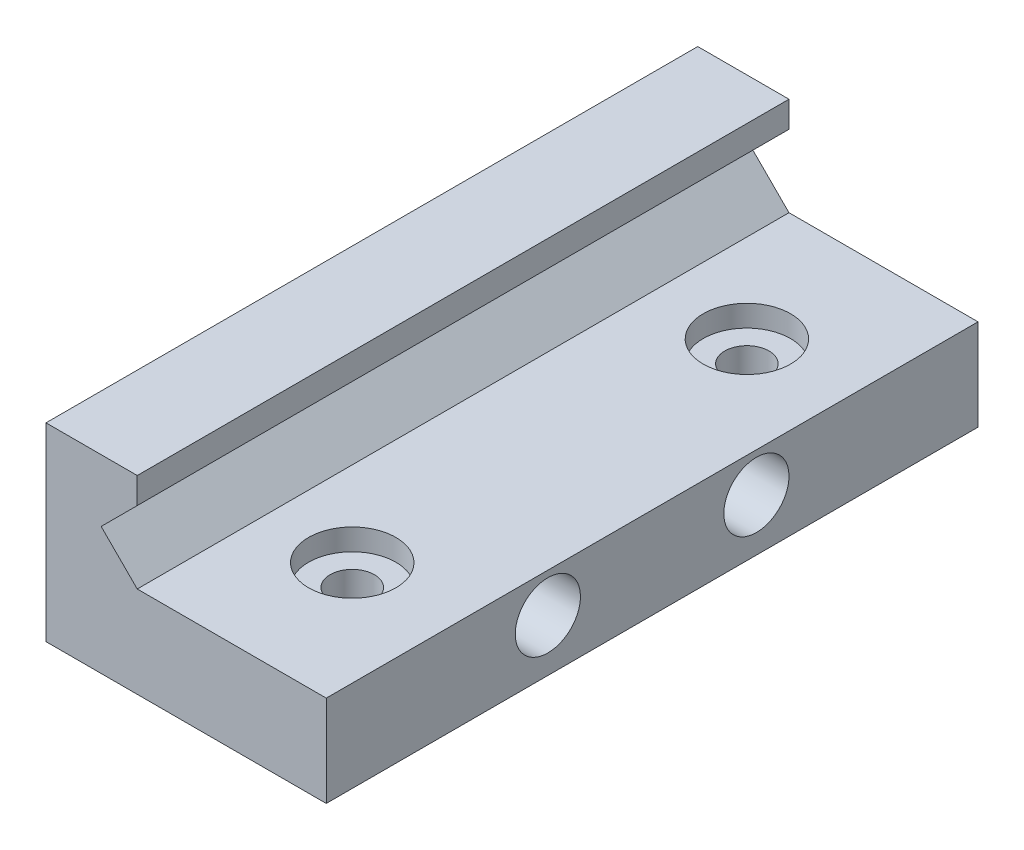
ISO-10303-21;
HEADER;
FILE_DESCRIPTION(('STEP AP214'),'2;1');
FILE_NAME('part.step','',(''),(''),'','','');
FILE_SCHEMA(('AUTOMOTIVE_DESIGN { 1 0 10303 214 1 1 1 1 }'));
ENDSEC;
DATA;
#1=APPLICATION_CONTEXT('core data for automotive mechanical design processes');
#2=APPLICATION_PROTOCOL_DEFINITION('international standard','automotive_design',2000,#1);
#3=PRODUCT_CONTEXT('',#1,'mechanical');
#4=PRODUCT('Part','Part','',(#3));
#5=PRODUCT_RELATED_PRODUCT_CATEGORY('part','',(#4));
#6=PRODUCT_DEFINITION_FORMATION('','',#4);
#7=PRODUCT_DEFINITION_CONTEXT('part definition',#1,'design');
#8=PRODUCT_DEFINITION('design','',#6,#7);
#9=PRODUCT_DEFINITION_SHAPE('','',#8);
#10=(LENGTH_UNIT() NAMED_UNIT(*) SI_UNIT(.MILLI.,.METRE.));
#11=(NAMED_UNIT(*) PLANE_ANGLE_UNIT() SI_UNIT($,.RADIAN.));
#12=(NAMED_UNIT(*) SI_UNIT($,.STERADIAN.) SOLID_ANGLE_UNIT());
#13=UNCERTAINTY_MEASURE_WITH_UNIT(LENGTH_MEASURE(1.E-05),#10,'distance_accuracy_value','');
#14=(GEOMETRIC_REPRESENTATION_CONTEXT(3) GLOBAL_UNCERTAINTY_ASSIGNED_CONTEXT((#13)) GLOBAL_UNIT_ASSIGNED_CONTEXT((#10,
#11,#12)) REPRESENTATION_CONTEXT('',''));
#15=CARTESIAN_POINT('',(0.,0.,0.));
#16=DIRECTION('',(0.,0.,1.));
#17=DIRECTION('',(1.,0.,0.));
#18=AXIS2_PLACEMENT_3D('',#15,#16,#17);
#19=CARTESIAN_POINT('',(-15.7134857516245,65.6371163031658,50.));
#20=DIRECTION('',(-1.,0.,0.));
#21=DIRECTION('',(0.,-1.,0.));
#22=AXIS2_PLACEMENT_3D('',#19,#20,#21);
#23=PLANE('',#22);
#24=DIRECTION('',(0.,1.,0.));
#25=VECTOR('',#24,1.);
#26=CARTESIAN_POINT('',(-15.7134857516245,65.6371163031658,0.));
#27=LINE('',#26,#25);
#28=CARTESIAN_POINT('',(-15.7134857516245,63.6371163031658,0.));
#29=VERTEX_POINT('',#28);
#30=CARTESIAN_POINT('',(-15.7134857516245,65.6371163031658,0.));
#31=VERTEX_POINT('',#30);
#32=EDGE_CURVE('E128',#29,#31,#27,.T.);
#33=ORIENTED_EDGE('',*,*,#32,.T.);
#34=DIRECTION('',(0.,0.,-1.));
#35=VECTOR('',#34,1.);
#36=CARTESIAN_POINT('',(-15.7134857516245,65.6371163031658,50.));
#37=LINE('',#36,#35);
#38=CARTESIAN_POINT('',(-15.7134857516245,65.6371163031658,50.));
#39=VERTEX_POINT('',#38);
#40=EDGE_CURVE('E11',#39,#31,#37,.T.);
#41=ORIENTED_EDGE('',*,*,#40,.F.);
#42=DIRECTION('',(0.,1.,0.));
#43=VECTOR('',#42,1.);
#44=CARTESIAN_POINT('',(-15.7134857516245,65.6371163031658,50.));
#45=LINE('',#44,#43);
#46=CARTESIAN_POINT('',(-15.7134857516245,63.6371163031658,50.));
#47=VERTEX_POINT('',#46);
#48=EDGE_CURVE('E143',#47,#39,#45,.T.);
#49=ORIENTED_EDGE('',*,*,#48,.F.);
#50=DIRECTION('',(0.,0.,-1.));
#51=VECTOR('',#50,1.);
#52=CARTESIAN_POINT('',(-15.7134857516245,63.6371163031658,50.));
#53=LINE('',#52,#51);
#54=EDGE_CURVE('E124',#47,#29,#53,.T.);
#55=ORIENTED_EDGE('',*,*,#54,.T.);
#56=EDGE_LOOP('',(#33,#41,#49,#55));
#57=FACE_BOUND('',#56,.T.);
#58=ADVANCED_FACE('F32',(#57),#23,.F.);
#59=CARTESIAN_POINT('',(-22.7134857516245,65.6371163031658,50.));
#60=DIRECTION('',(0.,-1.,0.));
#61=DIRECTION('',(0.,0.,-1.));
#62=AXIS2_PLACEMENT_3D('',#59,#60,#61);
#63=PLANE('',#62);
#64=DIRECTION('',(-1.,0.,0.));
#65=VECTOR('',#64,1.);
#66=CARTESIAN_POINT('',(-22.7134857516245,65.6371163031658,0.));
#67=LINE('',#66,#65);
#68=CARTESIAN_POINT('',(-22.7134857516245,65.6371163031658,0.));
#69=VERTEX_POINT('',#68);
#70=EDGE_CURVE('E131',#31,#69,#67,.T.);
#71=ORIENTED_EDGE('',*,*,#70,.T.);
#72=DIRECTION('',(0.,0.,-1.));
#73=VECTOR('',#72,1.);
#74=CARTESIAN_POINT('',(-22.7134857516245,65.6371163031658,50.));
#75=LINE('',#74,#73);
#76=CARTESIAN_POINT('',(-22.7134857516245,65.6371163031658,50.));
#77=VERTEX_POINT('',#76);
#78=EDGE_CURVE('E40',#77,#69,#75,.T.);
#79=ORIENTED_EDGE('',*,*,#78,.F.);
#80=DIRECTION('',(-1.,0.,0.));
#81=VECTOR('',#80,1.);
#82=CARTESIAN_POINT('',(-22.7134857516245,65.6371163031658,50.));
#83=LINE('',#82,#81);
#84=EDGE_CURVE('E91',#39,#77,#83,.T.);
#85=ORIENTED_EDGE('',*,*,#84,.F.);
#86=ORIENTED_EDGE('',*,*,#40,.T.);
#87=EDGE_LOOP('',(#71,#79,#85,#86));
#88=FACE_BOUND('',#87,.T.);
#89=ADVANCED_FACE('F237',(#88),#63,.F.);
#90=CARTESIAN_POINT('',(-22.7134857516245,51.0971163031658,50.));
#91=DIRECTION('',(1.,0.,0.));
#92=DIRECTION('',(0.,0.,-1.));
#93=AXIS2_PLACEMENT_3D('',#90,#91,#92);
#94=PLANE('',#93);
#95=CARTESIAN_POINT('',(-22.7134857516245,55.0971163031658,33.));
#96=DIRECTION('',(-1.,0.,0.));
#97=DIRECTION('',(0.,0.,1.));
#98=AXIS2_PLACEMENT_3D('',#95,#96,#97);
#99=CIRCLE('',#98,2.5);
#100=CARTESIAN_POINT('',(-22.7134857516245,55.0971163031658,35.5));
#101=VERTEX_POINT('',#100);
#102=EDGE_CURVE('E184',#101,#101,#99,.T.);
#103=ORIENTED_EDGE('',*,*,#102,.F.);
#104=EDGE_LOOP('',(#103));
#105=FACE_BOUND('',#104,.T.);
#106=CARTESIAN_POINT('',(-22.7134857516245,55.0971163031658,17.));
#107=DIRECTION('',(-1.,0.,0.));
#108=DIRECTION('',(0.,0.,1.));
#109=AXIS2_PLACEMENT_3D('',#106,#107,#108);
#110=CIRCLE('',#109,2.5);
#111=CARTESIAN_POINT('',(-22.7134857516245,55.0971163031658,19.5));
#112=VERTEX_POINT('',#111);
#113=EDGE_CURVE('E178',#112,#112,#110,.T.);
#114=ORIENTED_EDGE('',*,*,#113,.F.);
#115=EDGE_LOOP('',(#114));
#116=FACE_BOUND('',#115,.T.);
#117=DIRECTION('',(0.,-1.,0.));
#118=VECTOR('',#117,1.);
#119=CARTESIAN_POINT('',(-22.7134857516245,51.0971163031658,0.));
#120=LINE('',#119,#118);
#121=CARTESIAN_POINT('',(-22.7134857516245,51.0971163031658,0.));
#122=VERTEX_POINT('',#121);
#123=EDGE_CURVE('E134',#69,#122,#120,.T.);
#124=ORIENTED_EDGE('',*,*,#123,.T.);
#125=DIRECTION('',(0.,0.,-1.));
#126=VECTOR('',#125,1.);
#127=CARTESIAN_POINT('',(-22.7134857516245,51.0971163031658,50.));
#128=LINE('',#127,#126);
#129=CARTESIAN_POINT('',(-22.7134857516245,51.0971163031658,50.));
#130=VERTEX_POINT('',#129);
#131=EDGE_CURVE('E150',#130,#122,#128,.T.);
#132=ORIENTED_EDGE('',*,*,#131,.F.);
#133=DIRECTION('',(0.,-1.,0.));
#134=VECTOR('',#133,1.);
#135=CARTESIAN_POINT('',(-22.7134857516245,51.0971163031658,50.));
#136=LINE('',#135,#134);
#137=EDGE_CURVE('E158',#77,#130,#136,.T.);
#138=ORIENTED_EDGE('',*,*,#137,.F.);
#139=ORIENTED_EDGE('',*,*,#78,.T.);
#140=EDGE_LOOP('',(#124,#132,#138,#139));
#141=FACE_BOUND('',#140,.T.);
#142=ADVANCED_FACE('F156',(#105,#116,#141),#94,.F.);
#143=CARTESIAN_POINT('',(-1.21348575162475,51.0971163031658,50.));
#144=DIRECTION('',(0.,1.,0.));
#145=DIRECTION('',(0.,0.,1.));
#146=AXIS2_PLACEMENT_3D('',#143,#144,#145);
#147=PLANE('',#146);
#148=CARTESIAN_POINT('',(-9.21979977920273,51.0971163031658,40.));
#149=DIRECTION('',(0.,1.,0.));
#150=DIRECTION('',(0.,0.,1.));
#151=AXIS2_PLACEMENT_3D('',#148,#149,#150);
#152=CIRCLE('',#151,1.7);
#153=CARTESIAN_POINT('',(-9.21979977920273,51.0971163031658,41.7));
#154=VERTEX_POINT('',#153);
#155=EDGE_CURVE('E199',#154,#154,#152,.T.);
#156=ORIENTED_EDGE('',*,*,#155,.T.);
#157=EDGE_LOOP('',(#156));
#158=FACE_BOUND('',#157,.T.);
#159=CARTESIAN_POINT('',(-8.94348575162475,51.0971163031658,10.));
#160=DIRECTION('',(0.,1.,0.));
#161=DIRECTION('',(0.,0.,1.));
#162=AXIS2_PLACEMENT_3D('',#159,#160,#161);
#163=CIRCLE('',#162,1.7);
#164=CARTESIAN_POINT('',(-8.94348575162475,51.0971163031658,11.7));
#165=VERTEX_POINT('',#164);
#166=EDGE_CURVE('E187',#165,#165,#163,.T.);
#167=ORIENTED_EDGE('',*,*,#166,.T.);
#168=EDGE_LOOP('',(#167));
#169=FACE_BOUND('',#168,.T.);
#170=DIRECTION('',(1.,0.,0.));
#171=VECTOR('',#170,1.);
#172=CARTESIAN_POINT('',(-1.21348575162475,51.0971163031658,0.));
#173=LINE('',#172,#171);
#174=CARTESIAN_POINT('',(-1.21348575162475,51.0971163031658,0.));
#175=VERTEX_POINT('',#174);
#176=EDGE_CURVE('E136',#122,#175,#173,.T.);
#177=ORIENTED_EDGE('',*,*,#176,.T.);
#178=DIRECTION('',(0.,0.,-1.));
#179=VECTOR('',#178,1.);
#180=CARTESIAN_POINT('',(-1.21348575162475,51.0971163031658,50.));
#181=LINE('',#180,#179);
#182=CARTESIAN_POINT('',(-1.21348575162475,51.0971163031658,50.));
#183=VERTEX_POINT('',#182);
#184=EDGE_CURVE('E147',#183,#175,#181,.T.);
#185=ORIENTED_EDGE('',*,*,#184,.F.);
#186=DIRECTION('',(1.,0.,0.));
#187=VECTOR('',#186,1.);
#188=CARTESIAN_POINT('',(-1.21348575162475,51.0971163031658,50.));
#189=LINE('',#188,#187);
#190=EDGE_CURVE('E170',#130,#183,#189,.T.);
#191=ORIENTED_EDGE('',*,*,#190,.F.);
#192=ORIENTED_EDGE('',*,*,#131,.T.);
#193=EDGE_LOOP('',(#177,#185,#191,#192));
#194=FACE_BOUND('',#193,.T.);
#195=ADVANCED_FACE('F166',(#158,#169,#194),#147,.F.);
#196=CARTESIAN_POINT('',(-1.21348575162475,58.0971163031658,50.));
#197=DIRECTION('',(-1.,0.,0.));
#198=DIRECTION('',(0.,-1.,0.));
#199=AXIS2_PLACEMENT_3D('',#196,#197,#198);
#200=PLANE('',#199);
#201=CARTESIAN_POINT('',(-1.21348575162475,55.0971163031658,33.));
#202=DIRECTION('',(-1.,0.,0.));
#203=DIRECTION('',(0.,-1.,0.));
#204=AXIS2_PLACEMENT_3D('',#201,#202,#203);
#205=CIRCLE('',#204,2.5);
#206=CARTESIAN_POINT('',(-1.21348575162475,52.5971163031658,33.));
#207=VERTEX_POINT('',#206);
#208=EDGE_CURVE('E181',#207,#207,#205,.F.);
#209=ORIENTED_EDGE('',*,*,#208,.F.);
#210=EDGE_LOOP('',(#209));
#211=FACE_BOUND('',#210,.T.);
#212=CARTESIAN_POINT('',(-1.21348575162475,55.0971163031658,17.));
#213=DIRECTION('',(-1.,0.,0.));
#214=DIRECTION('',(0.,-1.,0.));
#215=AXIS2_PLACEMENT_3D('',#212,#213,#214);
#216=CIRCLE('',#215,2.5);
#217=CARTESIAN_POINT('',(-1.21348575162475,52.5971163031658,17.));
#218=VERTEX_POINT('',#217);
#219=EDGE_CURVE('E132',#218,#218,#216,.F.);
#220=ORIENTED_EDGE('',*,*,#219,.F.);
#221=EDGE_LOOP('',(#220));
#222=FACE_BOUND('',#221,.T.);
#223=DIRECTION('',(0.,1.,0.));
#224=VECTOR('',#223,1.);
#225=CARTESIAN_POINT('',(-1.21348575162475,58.0971163031658,0.));
#226=LINE('',#225,#224);
#227=CARTESIAN_POINT('',(-1.21348575162475,58.0971163031658,0.));
#228=VERTEX_POINT('',#227);
#229=EDGE_CURVE('E138',#175,#228,#226,.T.);
#230=ORIENTED_EDGE('',*,*,#229,.T.);
#231=DIRECTION('',(0.,0.,-1.));
#232=VECTOR('',#231,1.);
#233=CARTESIAN_POINT('',(-1.21348575162475,58.0971163031658,50.));
#234=LINE('',#233,#232);
#235=CARTESIAN_POINT('',(-1.21348575162475,58.0971163031658,50.));
#236=VERTEX_POINT('',#235);
#237=EDGE_CURVE('E119',#236,#228,#234,.T.);
#238=ORIENTED_EDGE('',*,*,#237,.F.);
#239=DIRECTION('',(0.,1.,0.));
#240=VECTOR('',#239,1.);
#241=CARTESIAN_POINT('',(-1.21348575162475,58.0971163031658,50.));
#242=LINE('',#241,#240);
#243=EDGE_CURVE('E110',#183,#236,#242,.T.);
#244=ORIENTED_EDGE('',*,*,#243,.F.);
#245=ORIENTED_EDGE('',*,*,#184,.T.);
#246=EDGE_LOOP('',(#230,#238,#244,#245));
#247=FACE_BOUND('',#246,.T.);
#248=ADVANCED_FACE('F169',(#211,#222,#247),#200,.F.);
#249=CARTESIAN_POINT('',(-15.7134857516248,58.0971163031658,50.));
#250=DIRECTION('',(0.,-1.,0.));
#251=DIRECTION('',(0.,0.,-1.));
#252=AXIS2_PLACEMENT_3D('',#249,#250,#251);
#253=PLANE('',#252);
#254=CARTESIAN_POINT('',(-9.21979977920273,58.0971163031658,40.));
#255=DIRECTION('',(0.,1.,0.));
#256=DIRECTION('',(0.,0.,1.));
#257=AXIS2_PLACEMENT_3D('',#254,#255,#256);
#258=CIRCLE('',#257,3.35);
#259=CARTESIAN_POINT('',(-9.21979977920273,58.0971163031658,43.35));
#260=VERTEX_POINT('',#259);
#261=EDGE_CURVE('E208',#260,#260,#258,.T.);
#262=ORIENTED_EDGE('',*,*,#261,.F.);
#263=EDGE_LOOP('',(#262));
#264=FACE_BOUND('',#263,.T.);
#265=CARTESIAN_POINT('',(-8.94348575162475,58.0971163031658,10.));
#266=DIRECTION('',(0.,1.,0.));
#267=DIRECTION('',(0.,0.,1.));
#268=AXIS2_PLACEMENT_3D('',#265,#266,#267);
#269=CIRCLE('',#268,3.35);
#270=CARTESIAN_POINT('',(-8.94348575162475,58.0971163031658,13.35));
#271=VERTEX_POINT('',#270);
#272=EDGE_CURVE('E196',#271,#271,#269,.T.);
#273=ORIENTED_EDGE('',*,*,#272,.F.);
#274=EDGE_LOOP('',(#273));
#275=FACE_BOUND('',#274,.T.);
#276=DIRECTION('',(-1.,0.,0.));
#277=VECTOR('',#276,1.);
#278=CARTESIAN_POINT('',(-15.7134857516248,58.0971163031658,0.));
#279=LINE('',#278,#277);
#280=CARTESIAN_POINT('',(-15.7134857516248,58.0971163031658,0.));
#281=VERTEX_POINT('',#280);
#282=EDGE_CURVE('E118',#228,#281,#279,.T.);
#283=ORIENTED_EDGE('',*,*,#282,.T.);
#284=DIRECTION('',(0.,0.,-1.));
#285=VECTOR('',#284,1.);
#286=CARTESIAN_POINT('',(-15.7134857516248,58.0971163031658,50.));
#287=LINE('',#286,#285);
#288=CARTESIAN_POINT('',(-15.7134857516248,58.0971163031658,50.));
#289=VERTEX_POINT('',#288);
#290=EDGE_CURVE('E115',#289,#281,#287,.T.);
#291=ORIENTED_EDGE('',*,*,#290,.F.);
#292=DIRECTION('',(-1.,0.,0.));
#293=VECTOR('',#292,1.);
#294=CARTESIAN_POINT('',(-15.7134857516248,58.0971163031658,50.));
#295=LINE('',#294,#293);
#296=EDGE_CURVE('E104',#236,#289,#295,.T.);
#297=ORIENTED_EDGE('',*,*,#296,.F.);
#298=ORIENTED_EDGE('',*,*,#237,.T.);
#299=EDGE_LOOP('',(#283,#291,#297,#298));
#300=FACE_BOUND('',#299,.T.);
#301=ADVANCED_FACE('F116',(#264,#275,#300),#253,.F.);
#302=CARTESIAN_POINT('',(-18.4834857516245,60.8671171277931,50.));
#303=DIRECTION('',(-0.707106886439182,-0.707106675933897,0.));
#304=DIRECTION('',(0.707106675933897,-0.707106886439182,0.));
#305=AXIS2_PLACEMENT_3D('',#302,#303,#304);
#306=PLANE('',#305);
#307=DIRECTION('',(-0.707106675933897,0.707106886439182,0.));
#308=VECTOR('',#307,1.);
#309=CARTESIAN_POINT('',(-18.4834857516245,60.8671171277931,0.));
#310=LINE('',#309,#308);
#311=CARTESIAN_POINT('',(-18.4834857516245,60.8671171277931,0.));
#312=VERTEX_POINT('',#311);
#313=EDGE_CURVE('E77',#281,#312,#310,.T.);
#314=ORIENTED_EDGE('',*,*,#313,.T.);
#315=DIRECTION('',(0.,0.,-1.));
#316=VECTOR('',#315,1.);
#317=CARTESIAN_POINT('',(-18.4834857516245,60.8671171277931,50.));
#318=LINE('',#317,#316);
#319=CARTESIAN_POINT('',(-18.4834857516245,60.8671171277931,50.));
#320=VERTEX_POINT('',#319);
#321=EDGE_CURVE('E120',#320,#312,#318,.T.);
#322=ORIENTED_EDGE('',*,*,#321,.F.);
#323=DIRECTION('',(-0.707106675933897,0.707106886439182,0.));
#324=VECTOR('',#323,1.);
#325=CARTESIAN_POINT('',(-18.4834857516245,60.8671171277931,50.));
#326=LINE('',#325,#324);
#327=EDGE_CURVE('E108',#289,#320,#326,.T.);
#328=ORIENTED_EDGE('',*,*,#327,.F.);
#329=ORIENTED_EDGE('',*,*,#290,.T.);
#330=EDGE_LOOP('',(#314,#322,#328,#329));
#331=FACE_BOUND('',#330,.T.);
#332=ADVANCED_FACE('F122',(#331),#306,.F.);
#333=CARTESIAN_POINT('',(-15.7134857516245,63.6371163031658,50.));
#334=DIRECTION('',(-0.707106675933894,0.707106886439185,0.));
#335=DIRECTION('',(-0.707106886439185,-0.707106675933894,0.));
#336=AXIS2_PLACEMENT_3D('',#333,#334,#335);
#337=PLANE('',#336);
#338=DIRECTION('',(0.707106886439185,0.707106675933894,0.));
#339=VECTOR('',#338,1.);
#340=CARTESIAN_POINT('',(-15.7134857516245,63.6371163031658,0.));
#341=LINE('',#340,#339);
#342=EDGE_CURVE('E83',#312,#29,#341,.T.);
#343=ORIENTED_EDGE('',*,*,#342,.T.);
#344=ORIENTED_EDGE('',*,*,#54,.F.);
#345=DIRECTION('',(0.707106886439185,0.707106675933894,0.));
#346=VECTOR('',#345,1.);
#347=CARTESIAN_POINT('',(-15.7134857516245,63.6371163031658,50.));
#348=LINE('',#347,#346);
#349=EDGE_CURVE('E48',#320,#47,#348,.T.);
#350=ORIENTED_EDGE('',*,*,#349,.F.);
#351=ORIENTED_EDGE('',*,*,#321,.T.);
#352=EDGE_LOOP('',(#343,#344,#350,#351));
#353=FACE_BOUND('',#352,.T.);
#354=ADVANCED_FACE('F244',(#353),#337,.F.);
#355=CARTESIAN_POINT('',(0.,0.,50.));
#356=DIRECTION('',(0.,0.,1.));
#357=DIRECTION('',(1.,0.,0.));
#358=AXIS2_PLACEMENT_3D('',#355,#356,#357);
#359=PLANE('',#358);
#360=ORIENTED_EDGE('',*,*,#48,.T.);
#361=ORIENTED_EDGE('',*,*,#84,.T.);
#362=ORIENTED_EDGE('',*,*,#137,.T.);
#363=ORIENTED_EDGE('',*,*,#190,.T.);
#364=ORIENTED_EDGE('',*,*,#243,.T.);
#365=ORIENTED_EDGE('',*,*,#296,.T.);
#366=ORIENTED_EDGE('',*,*,#327,.T.);
#367=ORIENTED_EDGE('',*,*,#349,.T.);
#368=EDGE_LOOP('',(#360,#361,#362,#363,#364,#365,#366,#367));
#369=FACE_BOUND('',#368,.T.);
#370=ADVANCED_FACE('F106',(#369),#359,.T.);
#371=CARTESIAN_POINT('',(0.,0.,0.));
#372=DIRECTION('',(0.,0.,1.));
#373=DIRECTION('',(1.,0.,0.));
#374=AXIS2_PLACEMENT_3D('',#371,#372,#373);
#375=PLANE('',#374);
#376=ORIENTED_EDGE('',*,*,#32,.F.);
#377=ORIENTED_EDGE('',*,*,#342,.F.);
#378=ORIENTED_EDGE('',*,*,#313,.F.);
#379=ORIENTED_EDGE('',*,*,#282,.F.);
#380=ORIENTED_EDGE('',*,*,#229,.F.);
#381=ORIENTED_EDGE('',*,*,#176,.F.);
#382=ORIENTED_EDGE('',*,*,#123,.F.);
#383=ORIENTED_EDGE('',*,*,#70,.F.);
#384=EDGE_LOOP('',(#376,#377,#378,#379,#380,#381,#382,#383));
#385=FACE_BOUND('',#384,.T.);
#386=ADVANCED_FACE('F162',(#385),#375,.F.);
#387=CARTESIAN_POINT('',(-1.21248575162475,55.0971163031658,17.));
#388=DIRECTION('',(-1.,0.,0.));
#389=DIRECTION('',(0.,0.,1.));
#390=AXIS2_PLACEMENT_3D('',#387,#388,#389);
#391=CYLINDRICAL_SURFACE('',#390,2.5);
#392=ORIENTED_EDGE('',*,*,#113,.T.);
#393=EDGE_LOOP('',(#392));
#394=FACE_BOUND('',#393,.T.);
#395=ORIENTED_EDGE('',*,*,#219,.T.);
#396=EDGE_LOOP('',(#395));
#397=FACE_BOUND('',#396,.T.);
#398=ADVANCED_FACE('F269',(#394,#397),#391,.F.);
#399=CARTESIAN_POINT('',(-1.21248575162475,55.0971163031658,33.));
#400=DIRECTION('',(-1.,0.,0.));
#401=DIRECTION('',(0.,0.,1.));
#402=AXIS2_PLACEMENT_3D('',#399,#400,#401);
#403=CYLINDRICAL_SURFACE('',#402,2.5);
#404=ORIENTED_EDGE('',*,*,#102,.T.);
#405=EDGE_LOOP('',(#404));
#406=FACE_BOUND('',#405,.T.);
#407=ORIENTED_EDGE('',*,*,#208,.T.);
#408=EDGE_LOOP('',(#407));
#409=FACE_BOUND('',#408,.T.);
#410=ADVANCED_FACE('F272',(#406,#409),#403,.F.);
#411=CARTESIAN_POINT('',(-8.94348575162475,58.0971163031658,10.));
#412=DIRECTION('',(0.,1.,0.));
#413=DIRECTION('',(0.,0.,1.));
#414=AXIS2_PLACEMENT_3D('',#411,#412,#413);
#415=CYLINDRICAL_SURFACE('',#414,1.7);
#416=ORIENTED_EDGE('',*,*,#166,.F.);
#417=EDGE_LOOP('',(#416));
#418=FACE_BOUND('',#417,.T.);
#419=CARTESIAN_POINT('',(-8.94348575162475,56.4471163031658,10.));
#420=DIRECTION('',(0.,1.,0.));
#421=DIRECTION('',(0.,0.,1.));
#422=AXIS2_PLACEMENT_3D('',#419,#420,#421);
#423=CIRCLE('',#422,1.7);
#424=CARTESIAN_POINT('',(-8.94348575162475,56.4471163031658,11.7));
#425=VERTEX_POINT('',#424);
#426=EDGE_CURVE('E190',#425,#425,#423,.T.);
#427=ORIENTED_EDGE('',*,*,#426,.T.);
#428=EDGE_LOOP('',(#427));
#429=FACE_BOUND('',#428,.T.);
#430=ADVANCED_FACE('F232',(#418,#429),#415,.F.);
#431=CARTESIAN_POINT('',(-7.24348575162475,56.4471163031658,10.));
#432=DIRECTION('',(0.,-1.,0.));
#433=DIRECTION('',(0.,0.,-1.));
#434=AXIS2_PLACEMENT_3D('',#431,#432,#433);
#435=PLANE('',#434);
#436=ORIENTED_EDGE('',*,*,#426,.F.);
#437=EDGE_LOOP('',(#436));
#438=FACE_BOUND('',#437,.T.);
#439=CARTESIAN_POINT('',(-8.94348575162475,56.4471163031658,10.));
#440=DIRECTION('',(0.,1.,0.));
#441=DIRECTION('',(0.,0.,1.));
#442=AXIS2_PLACEMENT_3D('',#439,#440,#441);
#443=CIRCLE('',#442,3.35);
#444=CARTESIAN_POINT('',(-8.94348575162475,56.4471163031658,13.35));
#445=VERTEX_POINT('',#444);
#446=EDGE_CURVE('E193',#445,#445,#443,.T.);
#447=ORIENTED_EDGE('',*,*,#446,.T.);
#448=EDGE_LOOP('',(#447));
#449=FACE_BOUND('',#448,.T.);
#450=ADVANCED_FACE('F222',(#438,#449),#435,.F.);
#451=CARTESIAN_POINT('',(-8.94348575162475,58.0971163031658,10.));
#452=DIRECTION('',(0.,1.,0.));
#453=DIRECTION('',(0.,0.,1.));
#454=AXIS2_PLACEMENT_3D('',#451,#452,#453);
#455=CYLINDRICAL_SURFACE('',#454,3.35);
#456=ORIENTED_EDGE('',*,*,#446,.F.);
#457=EDGE_LOOP('',(#456));
#458=FACE_BOUND('',#457,.T.);
#459=ORIENTED_EDGE('',*,*,#272,.T.);
#460=EDGE_LOOP('',(#459));
#461=FACE_BOUND('',#460,.T.);
#462=ADVANCED_FACE('F219',(#458,#461),#455,.F.);
#463=CARTESIAN_POINT('',(-9.21979977920273,58.0971163031658,40.));
#464=DIRECTION('',(0.,1.,0.));
#465=DIRECTION('',(0.,0.,1.));
#466=AXIS2_PLACEMENT_3D('',#463,#464,#465);
#467=CYLINDRICAL_SURFACE('',#466,1.7);
#468=ORIENTED_EDGE('',*,*,#155,.F.);
#469=EDGE_LOOP('',(#468));
#470=FACE_BOUND('',#469,.T.);
#471=CARTESIAN_POINT('',(-9.21979977920273,56.4471163031658,40.));
#472=DIRECTION('',(0.,1.,0.));
#473=DIRECTION('',(0.,0.,1.));
#474=AXIS2_PLACEMENT_3D('',#471,#472,#473);
#475=CIRCLE('',#474,1.7);
#476=CARTESIAN_POINT('',(-9.21979977920273,56.4471163031658,41.7));
#477=VERTEX_POINT('',#476);
#478=EDGE_CURVE('E202',#477,#477,#475,.T.);
#479=ORIENTED_EDGE('',*,*,#478,.T.);
#480=EDGE_LOOP('',(#479));
#481=FACE_BOUND('',#480,.T.);
#482=ADVANCED_FACE('F221',(#470,#481),#467,.F.);
#483=CARTESIAN_POINT('',(-7.51979977920273,56.4471163031658,40.));
#484=DIRECTION('',(0.,-1.,0.));
#485=DIRECTION('',(0.,0.,-1.));
#486=AXIS2_PLACEMENT_3D('',#483,#484,#485);
#487=PLANE('',#486);
#488=ORIENTED_EDGE('',*,*,#478,.F.);
#489=EDGE_LOOP('',(#488));
#490=FACE_BOUND('',#489,.T.);
#491=CARTESIAN_POINT('',(-9.21979977920273,56.4471163031658,40.));
#492=DIRECTION('',(0.,1.,0.));
#493=DIRECTION('',(0.,0.,1.));
#494=AXIS2_PLACEMENT_3D('',#491,#492,#493);
#495=CIRCLE('',#494,3.35);
#496=CARTESIAN_POINT('',(-9.21979977920273,56.4471163031658,43.35));
#497=VERTEX_POINT('',#496);
#498=EDGE_CURVE('E205',#497,#497,#495,.T.);
#499=ORIENTED_EDGE('',*,*,#498,.T.);
#500=EDGE_LOOP('',(#499));
#501=FACE_BOUND('',#500,.T.);
#502=ADVANCED_FACE('F229',(#490,#501),#487,.F.);
#503=CARTESIAN_POINT('',(-9.21979977920273,58.0971163031658,40.));
#504=DIRECTION('',(0.,1.,0.));
#505=DIRECTION('',(0.,0.,1.));
#506=AXIS2_PLACEMENT_3D('',#503,#504,#505);
#507=CYLINDRICAL_SURFACE('',#506,3.35);
#508=ORIENTED_EDGE('',*,*,#498,.F.);
#509=EDGE_LOOP('',(#508));
#510=FACE_BOUND('',#509,.T.);
#511=ORIENTED_EDGE('',*,*,#261,.T.);
#512=EDGE_LOOP('',(#511));
#513=FACE_BOUND('',#512,.T.);
#514=ADVANCED_FACE('F212',(#510,#513),#507,.F.);
#515=CLOSED_SHELL('',(#58,#89,#142,#195,#248,#301,#332,#354,#370,#386,#398,#410,#430,#450,#462,
#482,#502,#514));
#516=MANIFOLD_SOLID_BREP('B2',#515);
#517=ADVANCED_BREP_SHAPE_REPRESENTATION('',(#18,#516),#14);
#518=SHAPE_DEFINITION_REPRESENTATION(#9,#517);
ENDSEC;
END-ISO-10303-21;
